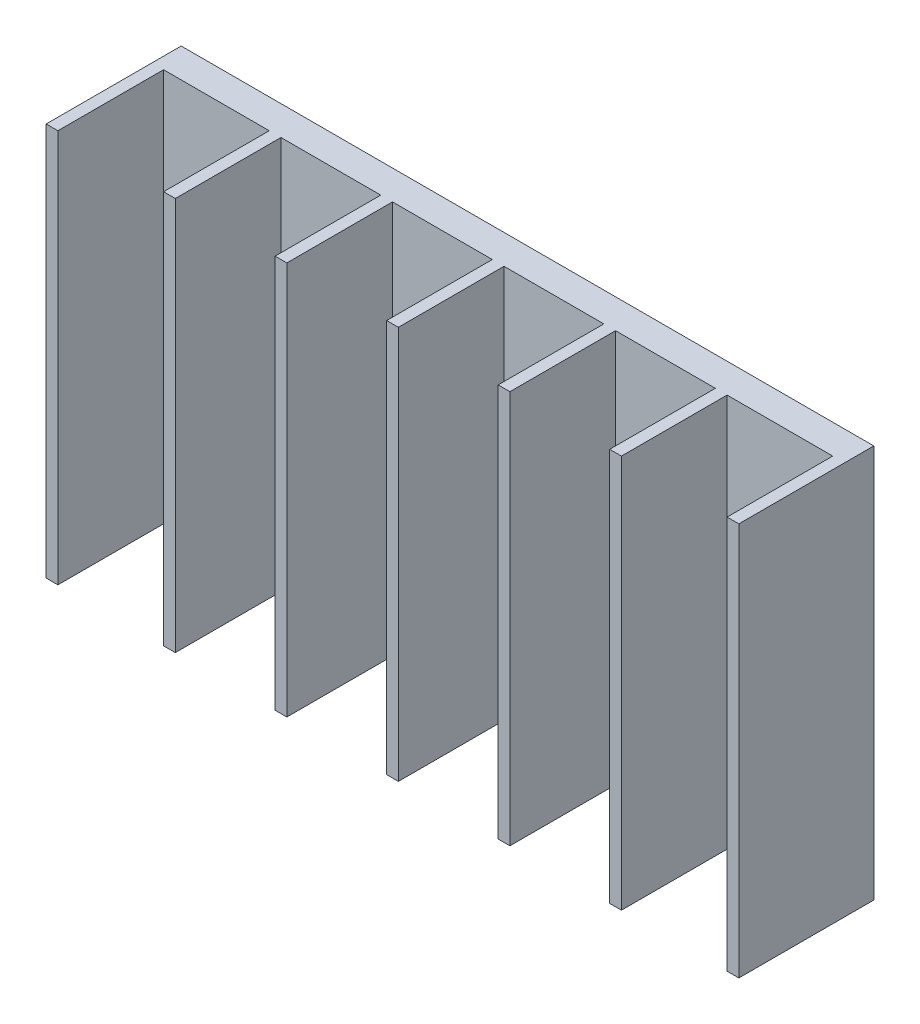
ISO-10303-21;
HEADER;
FILE_DESCRIPTION(('STEP AP214'),'2;1');
FILE_NAME('part.step','',(''),(''),'','','');
FILE_SCHEMA(('AUTOMOTIVE_DESIGN { 1 0 10303 214 1 1 1 1 }'));
ENDSEC;
DATA;
#1=APPLICATION_CONTEXT('core data for automotive mechanical design processes');
#2=APPLICATION_PROTOCOL_DEFINITION('international standard','automotive_design',2000,#1);
#3=PRODUCT_CONTEXT('',#1,'mechanical');
#4=PRODUCT('Part','Part','',(#3));
#5=PRODUCT_RELATED_PRODUCT_CATEGORY('part','',(#4));
#6=PRODUCT_DEFINITION_FORMATION('','',#4);
#7=PRODUCT_DEFINITION_CONTEXT('part definition',#1,'design');
#8=PRODUCT_DEFINITION('design','',#6,#7);
#9=PRODUCT_DEFINITION_SHAPE('','',#8);
#10=(LENGTH_UNIT() NAMED_UNIT(*) SI_UNIT(.MILLI.,.METRE.));
#11=(NAMED_UNIT(*) PLANE_ANGLE_UNIT() SI_UNIT($,.RADIAN.));
#12=(NAMED_UNIT(*) SI_UNIT($,.STERADIAN.) SOLID_ANGLE_UNIT());
#13=UNCERTAINTY_MEASURE_WITH_UNIT(LENGTH_MEASURE(1.E-05),#10,'distance_accuracy_value','');
#14=(GEOMETRIC_REPRESENTATION_CONTEXT(3) GLOBAL_UNCERTAINTY_ASSIGNED_CONTEXT((#13)) GLOBAL_UNIT_ASSIGNED_CONTEXT((#10,
#11,#12)) REPRESENTATION_CONTEXT('',''));
#15=CARTESIAN_POINT('',(0.,0.,0.));
#16=DIRECTION('',(0.,0.,1.));
#17=DIRECTION('',(1.,0.,0.));
#18=AXIS2_PLACEMENT_3D('',#15,#16,#17);
#19=CARTESIAN_POINT('',(0.,0.,2.5));
#20=DIRECTION('',(0.,0.,1.));
#21=DIRECTION('',(1.,0.,0.));
#22=AXIS2_PLACEMENT_3D('',#19,#20,#21);
#23=PLANE('',#22);
#24=DIRECTION('',(1.,0.,0.));
#25=VECTOR('',#24,1.);
#26=CARTESIAN_POINT('',(-57.,-33.5,2.5));
#27=LINE('',#26,#25);
#28=CARTESIAN_POINT('',(20.,-33.5,2.5));
#29=VERTEX_POINT('',#28);
#30=CARTESIAN_POINT('',(37.,-33.5,2.5));
#31=VERTEX_POINT('',#30);
#32=EDGE_CURVE('E429',#29,#31,#27,.T.);
#33=ORIENTED_EDGE('',*,*,#32,.T.);
#34=DIRECTION('',(0.,-1.,0.));
#35=VECTOR('',#34,1.);
#36=CARTESIAN_POINT('',(37.,33.5,2.5));
#37=LINE('',#36,#35);
#38=CARTESIAN_POINT('',(37.,33.5,2.5));
#39=VERTEX_POINT('',#38);
#40=EDGE_CURVE('E57',#39,#31,#37,.T.);
#41=ORIENTED_EDGE('',*,*,#40,.F.);
#42=DIRECTION('',(-1.,0.,0.));
#43=VECTOR('',#42,1.);
#44=CARTESIAN_POINT('',(-57.,33.5,2.5));
#45=LINE('',#44,#43);
#46=CARTESIAN_POINT('',(20.,33.5,2.5));
#47=VERTEX_POINT('',#46);
#48=EDGE_CURVE('E423',#39,#47,#45,.T.);
#49=ORIENTED_EDGE('',*,*,#48,.T.);
#50=DIRECTION('',(0.,1.,0.));
#51=VECTOR('',#50,1.);
#52=CARTESIAN_POINT('',(20.,33.5,2.5));
#53=LINE('',#52,#51);
#54=EDGE_CURVE('E316',#29,#47,#53,.T.);
#55=ORIENTED_EDGE('',*,*,#54,.F.);
#56=EDGE_LOOP('',(#33,#41,#49,#55));
#57=FACE_BOUND('',#56,.T.);
#58=ADVANCED_FACE('F39',(#57),#23,.T.);
#59=CARTESIAN_POINT('',(57.,33.5,2.5));
#60=VERTEX_POINT('',#59);
#61=CARTESIAN_POINT('',(39.,33.5,2.5));
#62=VERTEX_POINT('',#61);
#63=EDGE_CURVE('E65',#60,#62,#45,.T.);
#64=ORIENTED_EDGE('',*,*,#63,.T.);
#65=DIRECTION('',(0.,1.,0.));
#66=VECTOR('',#65,1.);
#67=CARTESIAN_POINT('',(39.,33.5,2.5));
#68=LINE('',#67,#66);
#69=CARTESIAN_POINT('',(39.,-33.5,2.5));
#70=VERTEX_POINT('',#69);
#71=EDGE_CURVE('E291',#70,#62,#68,.T.);
#72=ORIENTED_EDGE('',*,*,#71,.F.);
#73=CARTESIAN_POINT('',(57.,-33.5,2.5));
#74=VERTEX_POINT('',#73);
#75=EDGE_CURVE('E50',#70,#74,#27,.T.);
#76=ORIENTED_EDGE('',*,*,#75,.T.);
#77=DIRECTION('',(0.,1.,0.));
#78=VECTOR('',#77,1.);
#79=CARTESIAN_POINT('',(57.,33.5,2.5));
#80=LINE('',#79,#78);
#81=EDGE_CURVE('E418',#74,#60,#80,.T.);
#82=ORIENTED_EDGE('',*,*,#81,.T.);
#83=EDGE_LOOP('',(#64,#72,#76,#82));
#84=FACE_BOUND('',#83,.T.);
#85=ADVANCED_FACE('F492',(#84),#23,.T.);
#86=CARTESIAN_POINT('',(0.999999999999994,-33.5,2.5));
#87=VERTEX_POINT('',#86);
#88=CARTESIAN_POINT('',(17.9999999999999,-33.5,2.5));
#89=VERTEX_POINT('',#88);
#90=EDGE_CURVE('E430',#87,#89,#27,.T.);
#91=ORIENTED_EDGE('',*,*,#90,.T.);
#92=DIRECTION('',(0.,-1.,0.));
#93=VECTOR('',#92,1.);
#94=CARTESIAN_POINT('',(18.,33.5,2.5));
#95=LINE('',#94,#93);
#96=CARTESIAN_POINT('',(17.9999999999999,33.5,2.5));
#97=VERTEX_POINT('',#96);
#98=EDGE_CURVE('E311',#97,#89,#95,.T.);
#99=ORIENTED_EDGE('',*,*,#98,.F.);
#100=CARTESIAN_POINT('',(0.99999999999998,33.5,2.5));
#101=VERTEX_POINT('',#100);
#102=EDGE_CURVE('E455',#97,#101,#45,.T.);
#103=ORIENTED_EDGE('',*,*,#102,.T.);
#104=DIRECTION('',(0.,1.,0.));
#105=VECTOR('',#104,1.);
#106=CARTESIAN_POINT('',(0.99999999999998,33.5,2.5));
#107=LINE('',#106,#105);
#108=EDGE_CURVE('E343',#87,#101,#107,.T.);
#109=ORIENTED_EDGE('',*,*,#108,.F.);
#110=EDGE_LOOP('',(#91,#99,#103,#109));
#111=FACE_BOUND('',#110,.T.);
#112=ADVANCED_FACE('F497',(#111),#23,.T.);
#113=CARTESIAN_POINT('',(-18.,-33.5,2.5));
#114=VERTEX_POINT('',#113);
#115=CARTESIAN_POINT('',(-1.00000000000004,-33.5,2.5));
#116=VERTEX_POINT('',#115);
#117=EDGE_CURVE('E432',#114,#116,#27,.T.);
#118=ORIENTED_EDGE('',*,*,#117,.T.);
#119=DIRECTION('',(0.,-1.,0.));
#120=VECTOR('',#119,1.);
#121=CARTESIAN_POINT('',(-1.00000000000002,33.5,2.5));
#122=LINE('',#121,#120);
#123=CARTESIAN_POINT('',(-1.00000000000004,33.5,2.5));
#124=VERTEX_POINT('',#123);
#125=EDGE_CURVE('E338',#124,#116,#122,.T.);
#126=ORIENTED_EDGE('',*,*,#125,.F.);
#127=CARTESIAN_POINT('',(-18.,33.5,2.5));
#128=VERTEX_POINT('',#127);
#129=EDGE_CURVE('E454',#124,#128,#45,.T.);
#130=ORIENTED_EDGE('',*,*,#129,.T.);
#131=DIRECTION('',(0.,1.,0.));
#132=VECTOR('',#131,1.);
#133=CARTESIAN_POINT('',(-18.,33.5,2.5));
#134=LINE('',#133,#132);
#135=EDGE_CURVE('E370',#114,#128,#134,.T.);
#136=ORIENTED_EDGE('',*,*,#135,.F.);
#137=EDGE_LOOP('',(#118,#126,#130,#136));
#138=FACE_BOUND('',#137,.T.);
#139=ADVANCED_FACE('F501',(#138),#23,.T.);
#140=CARTESIAN_POINT('',(-37.,-33.5,2.5));
#141=VERTEX_POINT('',#140);
#142=CARTESIAN_POINT('',(-20.,-33.5,2.5));
#143=VERTEX_POINT('',#142);
#144=EDGE_CURVE('E48',#141,#143,#27,.T.);
#145=ORIENTED_EDGE('',*,*,#144,.T.);
#146=DIRECTION('',(0.,-1.,0.));
#147=VECTOR('',#146,1.);
#148=CARTESIAN_POINT('',(-20.,33.5,2.5));
#149=LINE('',#148,#147);
#150=CARTESIAN_POINT('',(-20.,33.5,2.5));
#151=VERTEX_POINT('',#150);
#152=EDGE_CURVE('E365',#151,#143,#149,.T.);
#153=ORIENTED_EDGE('',*,*,#152,.F.);
#154=CARTESIAN_POINT('',(-37.,33.5,2.5));
#155=VERTEX_POINT('',#154);
#156=EDGE_CURVE('E451',#151,#155,#45,.T.);
#157=ORIENTED_EDGE('',*,*,#156,.T.);
#158=DIRECTION('',(0.,1.,0.));
#159=VECTOR('',#158,1.);
#160=CARTESIAN_POINT('',(-37.,33.5,2.5));
#161=LINE('',#160,#159);
#162=EDGE_CURVE('E397',#141,#155,#161,.T.);
#163=ORIENTED_EDGE('',*,*,#162,.F.);
#164=EDGE_LOOP('',(#145,#153,#157,#163));
#165=FACE_BOUND('',#164,.T.);
#166=ADVANCED_FACE('F440',(#165),#23,.T.);
#167=DIRECTION('',(0.,-1.,0.));
#168=VECTOR('',#167,1.);
#169=CARTESIAN_POINT('',(-39.,33.5,2.5));
#170=LINE('',#169,#168);
#171=CARTESIAN_POINT('',(-39.,33.5,2.5));
#172=VERTEX_POINT('',#171);
#173=CARTESIAN_POINT('',(-39.,-33.5,2.5));
#174=VERTEX_POINT('',#173);
#175=EDGE_CURVE('E392',#172,#174,#170,.T.);
#176=ORIENTED_EDGE('',*,*,#175,.F.);
#177=CARTESIAN_POINT('',(-57.,33.5,2.5));
#178=VERTEX_POINT('',#177);
#179=EDGE_CURVE('E420',#172,#178,#45,.T.);
#180=ORIENTED_EDGE('',*,*,#179,.T.);
#181=DIRECTION('',(0.,-1.,0.));
#182=VECTOR('',#181,1.);
#183=CARTESIAN_POINT('',(-57.,33.5,2.5));
#184=LINE('',#183,#182);
#185=CARTESIAN_POINT('',(-57.,-33.5,2.5));
#186=VERTEX_POINT('',#185);
#187=EDGE_CURVE('E422',#178,#186,#184,.T.);
#188=ORIENTED_EDGE('',*,*,#187,.T.);
#189=EDGE_CURVE('E11',#186,#174,#27,.T.);
#190=ORIENTED_EDGE('',*,*,#189,.T.);
#191=EDGE_LOOP('',(#176,#180,#188,#190));
#192=FACE_BOUND('',#191,.T.);
#193=ADVANCED_FACE('F457',(#192),#23,.T.);
#194=CARTESIAN_POINT('',(-57.,33.5,2.5));
#195=DIRECTION('',(0.,-1.,0.));
#196=DIRECTION('',(0.,0.,-1.));
#197=AXIS2_PLACEMENT_3D('',#194,#195,#196);
#198=PLANE('',#197);
#199=DIRECTION('',(-1.,0.,0.));
#200=VECTOR('',#199,1.);
#201=CARTESIAN_POINT('',(-57.,33.5,-2.5));
#202=LINE('',#201,#200);
#203=CARTESIAN_POINT('',(59.,33.5,-2.5));
#204=VERTEX_POINT('',#203);
#205=CARTESIAN_POINT('',(-59.,33.5,-2.5));
#206=VERTEX_POINT('',#205);
#207=EDGE_CURVE('E228',#204,#206,#202,.T.);
#208=ORIENTED_EDGE('',*,*,#207,.T.);
#209=DIRECTION('',(0.,0.,-1.));
#210=VECTOR('',#209,1.);
#211=CARTESIAN_POINT('',(-59.,33.5,-2.5));
#212=LINE('',#211,#210);
#213=CARTESIAN_POINT('',(-59.,33.5,20.5));
#214=VERTEX_POINT('',#213);
#215=EDGE_CURVE('E274',#214,#206,#212,.T.);
#216=ORIENTED_EDGE('',*,*,#215,.F.);
#217=DIRECTION('',(1.,0.,0.));
#218=VECTOR('',#217,1.);
#219=CARTESIAN_POINT('',(-59.,33.5,20.5));
#220=LINE('',#219,#218);
#221=CARTESIAN_POINT('',(-57.,33.5,20.5));
#222=VERTEX_POINT('',#221);
#223=EDGE_CURVE('E276',#214,#222,#220,.T.);
#224=ORIENTED_EDGE('',*,*,#223,.T.);
#225=DIRECTION('',(0.,0.,-1.));
#226=VECTOR('',#225,1.);
#227=CARTESIAN_POINT('',(-57.,33.5,-2.5));
#228=LINE('',#227,#226);
#229=EDGE_CURVE('E270',#222,#178,#228,.T.);
#230=ORIENTED_EDGE('',*,*,#229,.T.);
#231=ORIENTED_EDGE('',*,*,#179,.F.);
#232=DIRECTION('',(0.,0.,-1.));
#233=VECTOR('',#232,1.);
#234=CARTESIAN_POINT('',(-39.,33.5,20.5));
#235=LINE('',#234,#233);
#236=CARTESIAN_POINT('',(-39.,33.5,20.5));
#237=VERTEX_POINT('',#236);
#238=EDGE_CURVE('E403',#237,#172,#235,.T.);
#239=ORIENTED_EDGE('',*,*,#238,.F.);
#240=DIRECTION('',(-1.,0.,0.));
#241=VECTOR('',#240,1.);
#242=CARTESIAN_POINT('',(-37.,33.5,20.5));
#243=LINE('',#242,#241);
#244=CARTESIAN_POINT('',(-37.,33.5,20.5));
#245=VERTEX_POINT('',#244);
#246=EDGE_CURVE('E401',#245,#237,#243,.T.);
#247=ORIENTED_EDGE('',*,*,#246,.F.);
#248=DIRECTION('',(0.,0.,-1.));
#249=VECTOR('',#248,1.);
#250=CARTESIAN_POINT('',(-37.,33.5,20.5));
#251=LINE('',#250,#249);
#252=EDGE_CURVE('E410',#245,#155,#251,.T.);
#253=ORIENTED_EDGE('',*,*,#252,.T.);
#254=ORIENTED_EDGE('',*,*,#156,.F.);
#255=DIRECTION('',(0.,0.,-1.));
#256=VECTOR('',#255,1.);
#257=CARTESIAN_POINT('',(-20.,33.5,20.5));
#258=LINE('',#257,#256);
#259=CARTESIAN_POINT('',(-20.,33.5,20.5));
#260=VERTEX_POINT('',#259);
#261=EDGE_CURVE('E376',#260,#151,#258,.T.);
#262=ORIENTED_EDGE('',*,*,#261,.F.);
#263=DIRECTION('',(-1.,0.,0.));
#264=VECTOR('',#263,1.);
#265=CARTESIAN_POINT('',(-18.,33.5,20.5));
#266=LINE('',#265,#264);
#267=CARTESIAN_POINT('',(-18.,33.5,20.5));
#268=VERTEX_POINT('',#267);
#269=EDGE_CURVE('E374',#268,#260,#266,.T.);
#270=ORIENTED_EDGE('',*,*,#269,.F.);
#271=DIRECTION('',(0.,0.,-1.));
#272=VECTOR('',#271,1.);
#273=CARTESIAN_POINT('',(-18.,33.5,20.5));
#274=LINE('',#273,#272);
#275=EDGE_CURVE('E383',#268,#128,#274,.T.);
#276=ORIENTED_EDGE('',*,*,#275,.T.);
#277=ORIENTED_EDGE('',*,*,#129,.F.);
#278=DIRECTION('',(0.,0.,-1.));
#279=VECTOR('',#278,1.);
#280=CARTESIAN_POINT('',(-1.00000000000002,33.5,20.5));
#281=LINE('',#280,#279);
#282=CARTESIAN_POINT('',(-1.00000000000002,33.5,20.5));
#283=VERTEX_POINT('',#282);
#284=EDGE_CURVE('E349',#283,#124,#281,.T.);
#285=ORIENTED_EDGE('',*,*,#284,.F.);
#286=DIRECTION('',(-1.,0.,0.));
#287=VECTOR('',#286,1.);
#288=CARTESIAN_POINT('',(0.99999999999998,33.5,20.5));
#289=LINE('',#288,#287);
#290=CARTESIAN_POINT('',(0.99999999999998,33.5,20.5));
#291=VERTEX_POINT('',#290);
#292=EDGE_CURVE('E347',#291,#283,#289,.T.);
#293=ORIENTED_EDGE('',*,*,#292,.F.);
#294=DIRECTION('',(0.,0.,-1.));
#295=VECTOR('',#294,1.);
#296=CARTESIAN_POINT('',(0.99999999999998,33.5,20.5));
#297=LINE('',#296,#295);
#298=EDGE_CURVE('E356',#291,#101,#297,.T.);
#299=ORIENTED_EDGE('',*,*,#298,.T.);
#300=ORIENTED_EDGE('',*,*,#102,.F.);
#301=DIRECTION('',(0.,0.,-1.));
#302=VECTOR('',#301,1.);
#303=CARTESIAN_POINT('',(18.,33.5,20.5));
#304=LINE('',#303,#302);
#305=CARTESIAN_POINT('',(18.,33.5,20.5));
#306=VERTEX_POINT('',#305);
#307=EDGE_CURVE('E322',#306,#97,#304,.T.);
#308=ORIENTED_EDGE('',*,*,#307,.F.);
#309=DIRECTION('',(-1.,0.,0.));
#310=VECTOR('',#309,1.);
#311=CARTESIAN_POINT('',(20.,33.5,20.5));
#312=LINE('',#311,#310);
#313=CARTESIAN_POINT('',(20.,33.5,20.5));
#314=VERTEX_POINT('',#313);
#315=EDGE_CURVE('E320',#314,#306,#312,.T.);
#316=ORIENTED_EDGE('',*,*,#315,.F.);
#317=DIRECTION('',(0.,0.,-1.));
#318=VECTOR('',#317,1.);
#319=CARTESIAN_POINT('',(20.,33.5,20.5));
#320=LINE('',#319,#318);
#321=EDGE_CURVE('E329',#314,#47,#320,.T.);
#322=ORIENTED_EDGE('',*,*,#321,.T.);
#323=ORIENTED_EDGE('',*,*,#48,.F.);
#324=DIRECTION('',(0.,0.,-1.));
#325=VECTOR('',#324,1.);
#326=CARTESIAN_POINT('',(37.,33.5,20.5));
#327=LINE('',#326,#325);
#328=CARTESIAN_POINT('',(37.,33.5,20.5));
#329=VERTEX_POINT('',#328);
#330=EDGE_CURVE('E297',#329,#39,#327,.T.);
#331=ORIENTED_EDGE('',*,*,#330,.F.);
#332=DIRECTION('',(-1.,0.,0.));
#333=VECTOR('',#332,1.);
#334=CARTESIAN_POINT('',(39.,33.5,20.5));
#335=LINE('',#334,#333);
#336=CARTESIAN_POINT('',(39.,33.5,20.5));
#337=VERTEX_POINT('',#336);
#338=EDGE_CURVE('E295',#337,#329,#335,.T.);
#339=ORIENTED_EDGE('',*,*,#338,.F.);
#340=DIRECTION('',(0.,0.,-1.));
#341=VECTOR('',#340,1.);
#342=CARTESIAN_POINT('',(39.,33.5,20.5));
#343=LINE('',#342,#341);
#344=EDGE_CURVE('E302',#337,#62,#343,.T.);
#345=ORIENTED_EDGE('',*,*,#344,.T.);
#346=ORIENTED_EDGE('',*,*,#63,.F.);
#347=DIRECTION('',(0.,0.,-1.));
#348=VECTOR('',#347,1.);
#349=CARTESIAN_POINT('',(57.,33.5,-2.5));
#350=LINE('',#349,#348);
#351=CARTESIAN_POINT('',(57.,33.5,20.5));
#352=VERTEX_POINT('',#351);
#353=EDGE_CURVE('E258',#352,#60,#350,.T.);
#354=ORIENTED_EDGE('',*,*,#353,.F.);
#355=DIRECTION('',(-1.,0.,0.));
#356=VECTOR('',#355,1.);
#357=CARTESIAN_POINT('',(59.,33.5,20.5));
#358=LINE('',#357,#356);
#359=CARTESIAN_POINT('',(59.,33.5,20.5));
#360=VERTEX_POINT('',#359);
#361=EDGE_CURVE('E251',#360,#352,#358,.T.);
#362=ORIENTED_EDGE('',*,*,#361,.F.);
#363=DIRECTION('',(0.,0.,-1.));
#364=VECTOR('',#363,1.);
#365=CARTESIAN_POINT('',(59.,33.5,-2.5));
#366=LINE('',#365,#364);
#367=EDGE_CURVE('E244',#360,#204,#366,.T.);
#368=ORIENTED_EDGE('',*,*,#367,.T.);
#369=EDGE_LOOP('',(#208,#216,#224,#230,#231,#239,#247,#253,#254,#262,#270,#276,#277,#285,#293,
#299,#300,#308,#316,#322,#323,#331,#339,#345,#346,#354,#362,#368));
#370=FACE_BOUND('',#369,.T.);
#371=ADVANCED_FACE('F41',(#370),#198,.F.);
#372=CARTESIAN_POINT('',(-57.,-33.5,2.5));
#373=DIRECTION('',(0.,1.,0.));
#374=DIRECTION('',(0.,0.,1.));
#375=AXIS2_PLACEMENT_3D('',#372,#373,#374);
#376=PLANE('',#375);
#377=DIRECTION('',(1.,0.,0.));
#378=VECTOR('',#377,1.);
#379=CARTESIAN_POINT('',(-57.,-33.5,-2.5));
#380=LINE('',#379,#378);
#381=CARTESIAN_POINT('',(-59.,-33.5,-2.49999999999999));
#382=VERTEX_POINT('',#381);
#383=CARTESIAN_POINT('',(59.,-33.5,-2.49999999999999));
#384=VERTEX_POINT('',#383);
#385=EDGE_CURVE('E43',#382,#384,#380,.T.);
#386=ORIENTED_EDGE('',*,*,#385,.T.);
#387=DIRECTION('',(0.,0.,1.));
#388=VECTOR('',#387,1.);
#389=CARTESIAN_POINT('',(59.,-33.5,-2.49999999999999));
#390=LINE('',#389,#388);
#391=CARTESIAN_POINT('',(59.,-33.5,20.5));
#392=VERTEX_POINT('',#391);
#393=EDGE_CURVE('E247',#384,#392,#390,.T.);
#394=ORIENTED_EDGE('',*,*,#393,.T.);
#395=DIRECTION('',(-1.,0.,0.));
#396=VECTOR('',#395,1.);
#397=CARTESIAN_POINT('',(59.,-33.5,20.5));
#398=LINE('',#397,#396);
#399=CARTESIAN_POINT('',(57.,-33.5,20.5));
#400=VERTEX_POINT('',#399);
#401=EDGE_CURVE('E257',#392,#400,#398,.T.);
#402=ORIENTED_EDGE('',*,*,#401,.T.);
#403=DIRECTION('',(0.,0.,1.));
#404=VECTOR('',#403,1.);
#405=CARTESIAN_POINT('',(57.,-33.5,-2.49999999999999));
#406=LINE('',#405,#404);
#407=EDGE_CURVE('E248',#74,#400,#406,.T.);
#408=ORIENTED_EDGE('',*,*,#407,.F.);
#409=ORIENTED_EDGE('',*,*,#75,.F.);
#410=DIRECTION('',(0.,0.,-1.));
#411=VECTOR('',#410,1.);
#412=CARTESIAN_POINT('',(39.,-33.5,20.5));
#413=LINE('',#412,#411);
#414=CARTESIAN_POINT('',(39.,-33.5,20.5));
#415=VERTEX_POINT('',#414);
#416=EDGE_CURVE('E305',#415,#70,#413,.T.);
#417=ORIENTED_EDGE('',*,*,#416,.F.);
#418=DIRECTION('',(1.,0.,0.));
#419=VECTOR('',#418,1.);
#420=CARTESIAN_POINT('',(39.,-33.5,20.5));
#421=LINE('',#420,#419);
#422=CARTESIAN_POINT('',(37.,-33.5,20.5));
#423=VERTEX_POINT('',#422);
#424=EDGE_CURVE('E290',#423,#415,#421,.T.);
#425=ORIENTED_EDGE('',*,*,#424,.F.);
#426=DIRECTION('',(0.,0.,-1.));
#427=VECTOR('',#426,1.);
#428=CARTESIAN_POINT('',(37.,-33.5,20.5));
#429=LINE('',#428,#427);
#430=EDGE_CURVE('E308',#423,#31,#429,.T.);
#431=ORIENTED_EDGE('',*,*,#430,.T.);
#432=ORIENTED_EDGE('',*,*,#32,.F.);
#433=DIRECTION('',(0.,0.,-1.));
#434=VECTOR('',#433,1.);
#435=CARTESIAN_POINT('',(20.,-33.5,20.5));
#436=LINE('',#435,#434);
#437=CARTESIAN_POINT('',(20.,-33.5,20.5));
#438=VERTEX_POINT('',#437);
#439=EDGE_CURVE('E332',#438,#29,#436,.T.);
#440=ORIENTED_EDGE('',*,*,#439,.F.);
#441=DIRECTION('',(1.,0.,0.));
#442=VECTOR('',#441,1.);
#443=CARTESIAN_POINT('',(20.,-33.5,20.5));
#444=LINE('',#443,#442);
#445=CARTESIAN_POINT('',(18.,-33.5,20.5));
#446=VERTEX_POINT('',#445);
#447=EDGE_CURVE('E315',#446,#438,#444,.T.);
#448=ORIENTED_EDGE('',*,*,#447,.F.);
#449=DIRECTION('',(0.,0.,-1.));
#450=VECTOR('',#449,1.);
#451=CARTESIAN_POINT('',(18.,-33.5,20.5));
#452=LINE('',#451,#450);
#453=EDGE_CURVE('E335',#446,#89,#452,.T.);
#454=ORIENTED_EDGE('',*,*,#453,.T.);
#455=ORIENTED_EDGE('',*,*,#90,.F.);
#456=DIRECTION('',(0.,0.,-1.));
#457=VECTOR('',#456,1.);
#458=CARTESIAN_POINT('',(0.999999999999994,-33.5,20.5));
#459=LINE('',#458,#457);
#460=CARTESIAN_POINT('',(0.999999999999994,-33.5,20.5));
#461=VERTEX_POINT('',#460);
#462=EDGE_CURVE('E359',#461,#87,#459,.T.);
#463=ORIENTED_EDGE('',*,*,#462,.F.);
#464=DIRECTION('',(1.,0.,0.));
#465=VECTOR('',#464,1.);
#466=CARTESIAN_POINT('',(0.999999999999994,-33.5,20.5));
#467=LINE('',#466,#465);
#468=CARTESIAN_POINT('',(-1.00000000000001,-33.5,20.5));
#469=VERTEX_POINT('',#468);
#470=EDGE_CURVE('E342',#469,#461,#467,.T.);
#471=ORIENTED_EDGE('',*,*,#470,.F.);
#472=DIRECTION('',(0.,0.,-1.));
#473=VECTOR('',#472,1.);
#474=CARTESIAN_POINT('',(-1.00000000000001,-33.5,20.5));
#475=LINE('',#474,#473);
#476=EDGE_CURVE('E362',#469,#116,#475,.T.);
#477=ORIENTED_EDGE('',*,*,#476,.T.);
#478=ORIENTED_EDGE('',*,*,#117,.F.);
#479=DIRECTION('',(0.,0.,-1.));
#480=VECTOR('',#479,1.);
#481=CARTESIAN_POINT('',(-18.,-33.5,20.5));
#482=LINE('',#481,#480);
#483=CARTESIAN_POINT('',(-18.,-33.5,20.5));
#484=VERTEX_POINT('',#483);
#485=EDGE_CURVE('E386',#484,#114,#482,.T.);
#486=ORIENTED_EDGE('',*,*,#485,.F.);
#487=DIRECTION('',(1.,0.,0.));
#488=VECTOR('',#487,1.);
#489=CARTESIAN_POINT('',(-18.,-33.5,20.5));
#490=LINE('',#489,#488);
#491=CARTESIAN_POINT('',(-20.,-33.5,20.5));
#492=VERTEX_POINT('',#491);
#493=EDGE_CURVE('E369',#492,#484,#490,.T.);
#494=ORIENTED_EDGE('',*,*,#493,.F.);
#495=DIRECTION('',(0.,0.,-1.));
#496=VECTOR('',#495,1.);
#497=CARTESIAN_POINT('',(-20.,-33.5,20.5));
#498=LINE('',#497,#496);
#499=EDGE_CURVE('E389',#492,#143,#498,.T.);
#500=ORIENTED_EDGE('',*,*,#499,.T.);
#501=ORIENTED_EDGE('',*,*,#144,.F.);
#502=DIRECTION('',(0.,0.,-1.));
#503=VECTOR('',#502,1.);
#504=CARTESIAN_POINT('',(-37.,-33.5,20.5));
#505=LINE('',#504,#503);
#506=CARTESIAN_POINT('',(-37.,-33.5,20.5));
#507=VERTEX_POINT('',#506);
#508=EDGE_CURVE('E413',#507,#141,#505,.T.);
#509=ORIENTED_EDGE('',*,*,#508,.F.);
#510=DIRECTION('',(1.,0.,0.));
#511=VECTOR('',#510,1.);
#512=CARTESIAN_POINT('',(-37.,-33.5,20.5));
#513=LINE('',#512,#511);
#514=CARTESIAN_POINT('',(-39.,-33.5,20.5));
#515=VERTEX_POINT('',#514);
#516=EDGE_CURVE('E396',#515,#507,#513,.T.);
#517=ORIENTED_EDGE('',*,*,#516,.F.);
#518=DIRECTION('',(0.,0.,-1.));
#519=VECTOR('',#518,1.);
#520=CARTESIAN_POINT('',(-39.,-33.5,20.5));
#521=LINE('',#520,#519);
#522=EDGE_CURVE('E239',#515,#174,#521,.T.);
#523=ORIENTED_EDGE('',*,*,#522,.T.);
#524=ORIENTED_EDGE('',*,*,#189,.F.);
#525=DIRECTION('',(0.,0.,1.));
#526=VECTOR('',#525,1.);
#527=CARTESIAN_POINT('',(-57.,-33.5,-2.49999999999999));
#528=LINE('',#527,#526);
#529=CARTESIAN_POINT('',(-57.,-33.5,20.5));
#530=VERTEX_POINT('',#529);
#531=EDGE_CURVE('E267',#186,#530,#528,.T.);
#532=ORIENTED_EDGE('',*,*,#531,.T.);
#533=DIRECTION('',(1.,0.,0.));
#534=VECTOR('',#533,1.);
#535=CARTESIAN_POINT('',(-59.,-33.5,20.5));
#536=LINE('',#535,#534);
#537=CARTESIAN_POINT('',(-59.,-33.5,20.5));
#538=VERTEX_POINT('',#537);
#539=EDGE_CURVE('E284',#538,#530,#536,.T.);
#540=ORIENTED_EDGE('',*,*,#539,.F.);
#541=DIRECTION('',(0.,0.,1.));
#542=VECTOR('',#541,1.);
#543=CARTESIAN_POINT('',(-59.,-33.5,-2.49999999999999));
#544=LINE('',#543,#542);
#545=EDGE_CURVE('E269',#382,#538,#544,.T.);
#546=ORIENTED_EDGE('',*,*,#545,.F.);
#547=EDGE_LOOP('',(#386,#394,#402,#408,#409,#417,#425,#431,#432,#440,#448,#454,#455,#463,#471,
#477,#478,#486,#494,#500,#501,#509,#517,#523,#524,#532,#540,#546));
#548=FACE_BOUND('',#547,.T.);
#549=ADVANCED_FACE('F444',(#548),#376,.F.);
#550=CARTESIAN_POINT('',(0.,0.,-2.5));
#551=DIRECTION('',(0.,0.,1.));
#552=DIRECTION('',(1.,0.,0.));
#553=AXIS2_PLACEMENT_3D('',#550,#551,#552);
#554=PLANE('',#553);
#555=ORIENTED_EDGE('',*,*,#207,.F.);
#556=DIRECTION('',(0.,-1.,0.));
#557=VECTOR('',#556,1.);
#558=CARTESIAN_POINT('',(59.,33.5,-2.5));
#559=LINE('',#558,#557);
#560=EDGE_CURVE('E231',#204,#384,#559,.T.);
#561=ORIENTED_EDGE('',*,*,#560,.T.);
#562=ORIENTED_EDGE('',*,*,#385,.F.);
#563=DIRECTION('',(0.,-1.,0.));
#564=VECTOR('',#563,1.);
#565=CARTESIAN_POINT('',(-59.,33.5,-2.5));
#566=LINE('',#565,#564);
#567=EDGE_CURVE('E234',#206,#382,#566,.T.);
#568=ORIENTED_EDGE('',*,*,#567,.F.);
#569=EDGE_LOOP('',(#555,#561,#562,#568));
#570=FACE_BOUND('',#569,.T.);
#571=ADVANCED_FACE('F230',(#570),#554,.F.);
#572=CARTESIAN_POINT('',(-39.,33.5,20.5));
#573=DIRECTION('',(1.,0.,0.));
#574=DIRECTION('',(0.,1.,0.));
#575=AXIS2_PLACEMENT_3D('',#572,#573,#574);
#576=PLANE('',#575);
#577=ORIENTED_EDGE('',*,*,#175,.T.);
#578=ORIENTED_EDGE('',*,*,#522,.F.);
#579=DIRECTION('',(0.,-1.,0.));
#580=VECTOR('',#579,1.);
#581=CARTESIAN_POINT('',(-39.,33.5,20.5));
#582=LINE('',#581,#580);
#583=EDGE_CURVE('E393',#237,#515,#582,.T.);
#584=ORIENTED_EDGE('',*,*,#583,.F.);
#585=ORIENTED_EDGE('',*,*,#238,.T.);
#586=EDGE_LOOP('',(#577,#578,#584,#585));
#587=FACE_BOUND('',#586,.T.);
#588=ADVANCED_FACE('F462',(#587),#576,.F.);
#589=CARTESIAN_POINT('',(-37.,33.5,20.5));
#590=DIRECTION('',(-1.,0.,0.));
#591=DIRECTION('',(0.,-1.,0.));
#592=AXIS2_PLACEMENT_3D('',#589,#590,#591);
#593=PLANE('',#592);
#594=ORIENTED_EDGE('',*,*,#162,.T.);
#595=ORIENTED_EDGE('',*,*,#252,.F.);
#596=DIRECTION('',(0.,1.,0.));
#597=VECTOR('',#596,1.);
#598=CARTESIAN_POINT('',(-37.,33.5,20.5));
#599=LINE('',#598,#597);
#600=EDGE_CURVE('E399',#507,#245,#599,.T.);
#601=ORIENTED_EDGE('',*,*,#600,.F.);
#602=ORIENTED_EDGE('',*,*,#508,.T.);
#603=EDGE_LOOP('',(#594,#595,#601,#602));
#604=FACE_BOUND('',#603,.T.);
#605=ADVANCED_FACE('F468',(#604),#593,.F.);
#606=CARTESIAN_POINT('',(0.,0.,20.5));
#607=DIRECTION('',(0.,0.,-1.));
#608=DIRECTION('',(-1.,0.,0.));
#609=AXIS2_PLACEMENT_3D('',#606,#607,#608);
#610=PLANE('',#609);
#611=ORIENTED_EDGE('',*,*,#583,.T.);
#612=ORIENTED_EDGE('',*,*,#516,.T.);
#613=ORIENTED_EDGE('',*,*,#600,.T.);
#614=ORIENTED_EDGE('',*,*,#246,.T.);
#615=EDGE_LOOP('',(#611,#612,#613,#614));
#616=FACE_BOUND('',#615,.T.);
#617=ADVANCED_FACE('F465',(#616),#610,.F.);
#618=CARTESIAN_POINT('',(-20.,33.5,20.5));
#619=DIRECTION('',(1.,0.,0.));
#620=DIRECTION('',(0.,1.,0.));
#621=AXIS2_PLACEMENT_3D('',#618,#619,#620);
#622=PLANE('',#621);
#623=ORIENTED_EDGE('',*,*,#152,.T.);
#624=ORIENTED_EDGE('',*,*,#499,.F.);
#625=DIRECTION('',(0.,-1.,0.));
#626=VECTOR('',#625,1.);
#627=CARTESIAN_POINT('',(-20.,33.5,20.5));
#628=LINE('',#627,#626);
#629=EDGE_CURVE('E366',#260,#492,#628,.T.);
#630=ORIENTED_EDGE('',*,*,#629,.F.);
#631=ORIENTED_EDGE('',*,*,#261,.T.);
#632=EDGE_LOOP('',(#623,#624,#630,#631));
#633=FACE_BOUND('',#632,.T.);
#634=ADVANCED_FACE('F448',(#633),#622,.F.);
#635=CARTESIAN_POINT('',(-18.,33.5,20.5));
#636=DIRECTION('',(-1.,0.,0.));
#637=DIRECTION('',(0.,-1.,0.));
#638=AXIS2_PLACEMENT_3D('',#635,#636,#637);
#639=PLANE('',#638);
#640=ORIENTED_EDGE('',*,*,#135,.T.);
#641=ORIENTED_EDGE('',*,*,#275,.F.);
#642=DIRECTION('',(0.,1.,0.));
#643=VECTOR('',#642,1.);
#644=CARTESIAN_POINT('',(-18.,33.5,20.5));
#645=LINE('',#644,#643);
#646=EDGE_CURVE('E372',#484,#268,#645,.T.);
#647=ORIENTED_EDGE('',*,*,#646,.F.);
#648=ORIENTED_EDGE('',*,*,#485,.T.);
#649=EDGE_LOOP('',(#640,#641,#647,#648));
#650=FACE_BOUND('',#649,.T.);
#651=ADVANCED_FACE('F634',(#650),#639,.F.);
#652=CARTESIAN_POINT('',(19.,0.,20.5));
#653=DIRECTION('',(0.,0.,-1.));
#654=DIRECTION('',(-1.,0.,0.));
#655=AXIS2_PLACEMENT_3D('',#652,#653,#654);
#656=PLANE('',#655);
#657=ORIENTED_EDGE('',*,*,#629,.T.);
#658=ORIENTED_EDGE('',*,*,#493,.T.);
#659=ORIENTED_EDGE('',*,*,#646,.T.);
#660=ORIENTED_EDGE('',*,*,#269,.T.);
#661=EDGE_LOOP('',(#657,#658,#659,#660));
#662=FACE_BOUND('',#661,.T.);
#663=ADVANCED_FACE('F630',(#662),#656,.F.);
#664=CARTESIAN_POINT('',(-1.00000000000002,33.5,20.5));
#665=DIRECTION('',(1.,0.,0.));
#666=DIRECTION('',(0.,1.,0.));
#667=AXIS2_PLACEMENT_3D('',#664,#665,#666);
#668=PLANE('',#667);
#669=ORIENTED_EDGE('',*,*,#125,.T.);
#670=ORIENTED_EDGE('',*,*,#476,.F.);
#671=DIRECTION('',(0.,-1.,0.));
#672=VECTOR('',#671,1.);
#673=CARTESIAN_POINT('',(-1.00000000000002,33.5,20.5));
#674=LINE('',#673,#672);
#675=EDGE_CURVE('E339',#283,#469,#674,.T.);
#676=ORIENTED_EDGE('',*,*,#675,.F.);
#677=ORIENTED_EDGE('',*,*,#284,.T.);
#678=EDGE_LOOP('',(#669,#670,#676,#677));
#679=FACE_BOUND('',#678,.T.);
#680=ADVANCED_FACE('F627',(#679),#668,.F.);
#681=CARTESIAN_POINT('',(0.99999999999998,33.5,20.5));
#682=DIRECTION('',(-1.,0.,0.));
#683=DIRECTION('',(0.,-1.,0.));
#684=AXIS2_PLACEMENT_3D('',#681,#682,#683);
#685=PLANE('',#684);
#686=ORIENTED_EDGE('',*,*,#108,.T.);
#687=ORIENTED_EDGE('',*,*,#298,.F.);
#688=DIRECTION('',(0.,1.,0.));
#689=VECTOR('',#688,1.);
#690=CARTESIAN_POINT('',(0.99999999999998,33.5,20.5));
#691=LINE('',#690,#689);
#692=EDGE_CURVE('E345',#461,#291,#691,.T.);
#693=ORIENTED_EDGE('',*,*,#692,.F.);
#694=ORIENTED_EDGE('',*,*,#462,.T.);
#695=EDGE_LOOP('',(#686,#687,#693,#694));
#696=FACE_BOUND('',#695,.T.);
#697=ADVANCED_FACE('F593',(#696),#685,.F.);
#698=CARTESIAN_POINT('',(38.,0.,20.5));
#699=DIRECTION('',(0.,0.,-1.));
#700=DIRECTION('',(-1.,0.,0.));
#701=AXIS2_PLACEMENT_3D('',#698,#699,#700);
#702=PLANE('',#701);
#703=ORIENTED_EDGE('',*,*,#675,.T.);
#704=ORIENTED_EDGE('',*,*,#470,.T.);
#705=ORIENTED_EDGE('',*,*,#692,.T.);
#706=ORIENTED_EDGE('',*,*,#292,.T.);
#707=EDGE_LOOP('',(#703,#704,#705,#706));
#708=FACE_BOUND('',#707,.T.);
#709=ADVANCED_FACE('F601',(#708),#702,.F.);
#710=CARTESIAN_POINT('',(18.,33.5,20.5));
#711=DIRECTION('',(1.,0.,0.));
#712=DIRECTION('',(0.,1.,0.));
#713=AXIS2_PLACEMENT_3D('',#710,#711,#712);
#714=PLANE('',#713);
#715=ORIENTED_EDGE('',*,*,#98,.T.);
#716=ORIENTED_EDGE('',*,*,#453,.F.);
#717=DIRECTION('',(0.,-1.,0.));
#718=VECTOR('',#717,1.);
#719=CARTESIAN_POINT('',(18.,33.5,20.5));
#720=LINE('',#719,#718);
#721=EDGE_CURVE('E312',#306,#446,#720,.T.);
#722=ORIENTED_EDGE('',*,*,#721,.F.);
#723=ORIENTED_EDGE('',*,*,#307,.T.);
#724=EDGE_LOOP('',(#715,#716,#722,#723));
#725=FACE_BOUND('',#724,.T.);
#726=ADVANCED_FACE('F607',(#725),#714,.F.);
#727=CARTESIAN_POINT('',(20.,33.5,20.5));
#728=DIRECTION('',(-1.,0.,0.));
#729=DIRECTION('',(0.,-1.,0.));
#730=AXIS2_PLACEMENT_3D('',#727,#728,#729);
#731=PLANE('',#730);
#732=ORIENTED_EDGE('',*,*,#54,.T.);
#733=ORIENTED_EDGE('',*,*,#321,.F.);
#734=DIRECTION('',(0.,1.,0.));
#735=VECTOR('',#734,1.);
#736=CARTESIAN_POINT('',(20.,33.5,20.5));
#737=LINE('',#736,#735);
#738=EDGE_CURVE('E318',#438,#314,#737,.T.);
#739=ORIENTED_EDGE('',*,*,#738,.F.);
#740=ORIENTED_EDGE('',*,*,#439,.T.);
#741=EDGE_LOOP('',(#732,#733,#739,#740));
#742=FACE_BOUND('',#741,.T.);
#743=ADVANCED_FACE('F612',(#742),#731,.F.);
#744=CARTESIAN_POINT('',(57.,0.,20.5));
#745=DIRECTION('',(0.,0.,-1.));
#746=DIRECTION('',(-1.,0.,0.));
#747=AXIS2_PLACEMENT_3D('',#744,#745,#746);
#748=PLANE('',#747);
#749=ORIENTED_EDGE('',*,*,#721,.T.);
#750=ORIENTED_EDGE('',*,*,#447,.T.);
#751=ORIENTED_EDGE('',*,*,#738,.T.);
#752=ORIENTED_EDGE('',*,*,#315,.T.);
#753=EDGE_LOOP('',(#749,#750,#751,#752));
#754=FACE_BOUND('',#753,.T.);
#755=ADVANCED_FACE('F609',(#754),#748,.F.);
#756=CARTESIAN_POINT('',(37.,33.5,20.5));
#757=DIRECTION('',(1.,0.,0.));
#758=DIRECTION('',(0.,1.,0.));
#759=AXIS2_PLACEMENT_3D('',#756,#757,#758);
#760=PLANE('',#759);
#761=ORIENTED_EDGE('',*,*,#40,.T.);
#762=ORIENTED_EDGE('',*,*,#430,.F.);
#763=DIRECTION('',(0.,-1.,0.));
#764=VECTOR('',#763,1.);
#765=CARTESIAN_POINT('',(37.,33.5,20.5));
#766=LINE('',#765,#764);
#767=EDGE_CURVE('E287',#329,#423,#766,.T.);
#768=ORIENTED_EDGE('',*,*,#767,.F.);
#769=ORIENTED_EDGE('',*,*,#330,.T.);
#770=EDGE_LOOP('',(#761,#762,#768,#769));
#771=FACE_BOUND('',#770,.T.);
#772=ADVANCED_FACE('F586',(#771),#760,.F.);
#773=CARTESIAN_POINT('',(39.,33.5,20.5));
#774=DIRECTION('',(-1.,0.,0.));
#775=DIRECTION('',(0.,-1.,0.));
#776=AXIS2_PLACEMENT_3D('',#773,#774,#775);
#777=PLANE('',#776);
#778=ORIENTED_EDGE('',*,*,#71,.T.);
#779=ORIENTED_EDGE('',*,*,#344,.F.);
#780=DIRECTION('',(0.,1.,0.));
#781=VECTOR('',#780,1.);
#782=CARTESIAN_POINT('',(39.,33.5,20.5));
#783=LINE('',#782,#781);
#784=EDGE_CURVE('E293',#415,#337,#783,.T.);
#785=ORIENTED_EDGE('',*,*,#784,.F.);
#786=ORIENTED_EDGE('',*,*,#416,.T.);
#787=EDGE_LOOP('',(#778,#779,#785,#786));
#788=FACE_BOUND('',#787,.T.);
#789=ADVANCED_FACE('F580',(#788),#777,.F.);
#790=CARTESIAN_POINT('',(76.,0.,20.5));
#791=DIRECTION('',(0.,0.,-1.));
#792=DIRECTION('',(-1.,0.,0.));
#793=AXIS2_PLACEMENT_3D('',#790,#791,#792);
#794=PLANE('',#793);
#795=ORIENTED_EDGE('',*,*,#767,.T.);
#796=ORIENTED_EDGE('',*,*,#424,.T.);
#797=ORIENTED_EDGE('',*,*,#784,.T.);
#798=ORIENTED_EDGE('',*,*,#338,.T.);
#799=EDGE_LOOP('',(#795,#796,#797,#798));
#800=FACE_BOUND('',#799,.T.);
#801=ADVANCED_FACE('F584',(#800),#794,.F.);
#802=CARTESIAN_POINT('',(-59.,33.5,20.5));
#803=DIRECTION('',(0.,0.,-1.));
#804=DIRECTION('',(0.,1.,0.));
#805=AXIS2_PLACEMENT_3D('',#802,#803,#804);
#806=PLANE('',#805);
#807=DIRECTION('',(0.,1.,0.));
#808=VECTOR('',#807,1.);
#809=CARTESIAN_POINT('',(-57.,33.5,20.5));
#810=LINE('',#809,#808);
#811=EDGE_CURVE('E278',#530,#222,#810,.T.);
#812=ORIENTED_EDGE('',*,*,#811,.T.);
#813=ORIENTED_EDGE('',*,*,#223,.F.);
#814=DIRECTION('',(0.,1.,0.));
#815=VECTOR('',#814,1.);
#816=CARTESIAN_POINT('',(-59.,33.5,20.5));
#817=LINE('',#816,#815);
#818=EDGE_CURVE('E272',#538,#214,#817,.T.);
#819=ORIENTED_EDGE('',*,*,#818,.F.);
#820=ORIENTED_EDGE('',*,*,#539,.T.);
#821=EDGE_LOOP('',(#812,#813,#819,#820));
#822=FACE_BOUND('',#821,.T.);
#823=ADVANCED_FACE('F475',(#822),#806,.F.);
#824=CARTESIAN_POINT('',(-59.,0.,0.));
#825=DIRECTION('',(-1.,0.,0.));
#826=DIRECTION('',(0.,-1.,0.));
#827=AXIS2_PLACEMENT_3D('',#824,#825,#826);
#828=PLANE('',#827);
#829=ORIENTED_EDGE('',*,*,#567,.T.);
#830=ORIENTED_EDGE('',*,*,#545,.T.);
#831=ORIENTED_EDGE('',*,*,#818,.T.);
#832=ORIENTED_EDGE('',*,*,#215,.T.);
#833=EDGE_LOOP('',(#829,#830,#831,#832));
#834=FACE_BOUND('',#833,.T.);
#835=ADVANCED_FACE('F480',(#834),#828,.T.);
#836=CARTESIAN_POINT('',(-57.,0.,0.));
#837=DIRECTION('',(-1.,0.,0.));
#838=DIRECTION('',(0.,-1.,0.));
#839=AXIS2_PLACEMENT_3D('',#836,#837,#838);
#840=PLANE('',#839);
#841=ORIENTED_EDGE('',*,*,#187,.F.);
#842=ORIENTED_EDGE('',*,*,#229,.F.);
#843=ORIENTED_EDGE('',*,*,#811,.F.);
#844=ORIENTED_EDGE('',*,*,#531,.F.);
#845=EDGE_LOOP('',(#841,#842,#843,#844));
#846=FACE_BOUND('',#845,.T.);
#847=ADVANCED_FACE('F477',(#846),#840,.F.);
#848=CARTESIAN_POINT('',(59.,33.5,20.5));
#849=DIRECTION('',(0.,0.,1.));
#850=DIRECTION('',(0.,-1.,0.));
#851=AXIS2_PLACEMENT_3D('',#848,#849,#850);
#852=PLANE('',#851);
#853=DIRECTION('',(0.,1.,0.));
#854=VECTOR('',#853,1.);
#855=CARTESIAN_POINT('',(57.,33.5,20.5));
#856=LINE('',#855,#854);
#857=EDGE_CURVE('E260',#400,#352,#856,.T.);
#858=ORIENTED_EDGE('',*,*,#857,.F.);
#859=ORIENTED_EDGE('',*,*,#401,.F.);
#860=DIRECTION('',(0.,1.,0.));
#861=VECTOR('',#860,1.);
#862=CARTESIAN_POINT('',(59.,33.5,20.5));
#863=LINE('',#862,#861);
#864=EDGE_CURVE('E252',#392,#360,#863,.T.);
#865=ORIENTED_EDGE('',*,*,#864,.T.);
#866=ORIENTED_EDGE('',*,*,#361,.T.);
#867=EDGE_LOOP('',(#858,#859,#865,#866));
#868=FACE_BOUND('',#867,.T.);
#869=ADVANCED_FACE('F479',(#868),#852,.T.);
#870=CARTESIAN_POINT('',(59.,0.,0.));
#871=DIRECTION('',(1.,0.,0.));
#872=DIRECTION('',(0.,-1.,0.));
#873=AXIS2_PLACEMENT_3D('',#870,#871,#872);
#874=PLANE('',#873);
#875=ORIENTED_EDGE('',*,*,#560,.F.);
#876=ORIENTED_EDGE('',*,*,#367,.F.);
#877=ORIENTED_EDGE('',*,*,#864,.F.);
#878=ORIENTED_EDGE('',*,*,#393,.F.);
#879=EDGE_LOOP('',(#875,#876,#877,#878));
#880=FACE_BOUND('',#879,.T.);
#881=ADVANCED_FACE('F242',(#880),#874,.T.);
#882=CARTESIAN_POINT('',(57.,0.,0.));
#883=DIRECTION('',(1.,0.,0.));
#884=DIRECTION('',(0.,-1.,0.));
#885=AXIS2_PLACEMENT_3D('',#882,#883,#884);
#886=PLANE('',#885);
#887=ORIENTED_EDGE('',*,*,#81,.F.);
#888=ORIENTED_EDGE('',*,*,#407,.T.);
#889=ORIENTED_EDGE('',*,*,#857,.T.);
#890=ORIENTED_EDGE('',*,*,#353,.T.);
#891=EDGE_LOOP('',(#887,#888,#889,#890));
#892=FACE_BOUND('',#891,.T.);
#893=ADVANCED_FACE('F559',(#892),#886,.F.);
#894=CLOSED_SHELL('',(#58,#85,#112,#139,#166,#193,#371,#549,#571,#588,#605,#617,#634,#651,#663,
#680,#697,#709,#726,#743,#755,#772,#789,#801,#823,#835,#847,#869,#881,#893));
#895=MANIFOLD_SOLID_BREP('B2',#894);
#896=ADVANCED_BREP_SHAPE_REPRESENTATION('',(#18,#895),#14);
#897=SHAPE_DEFINITION_REPRESENTATION(#9,#896);
ENDSEC;
END-ISO-10303-21;
